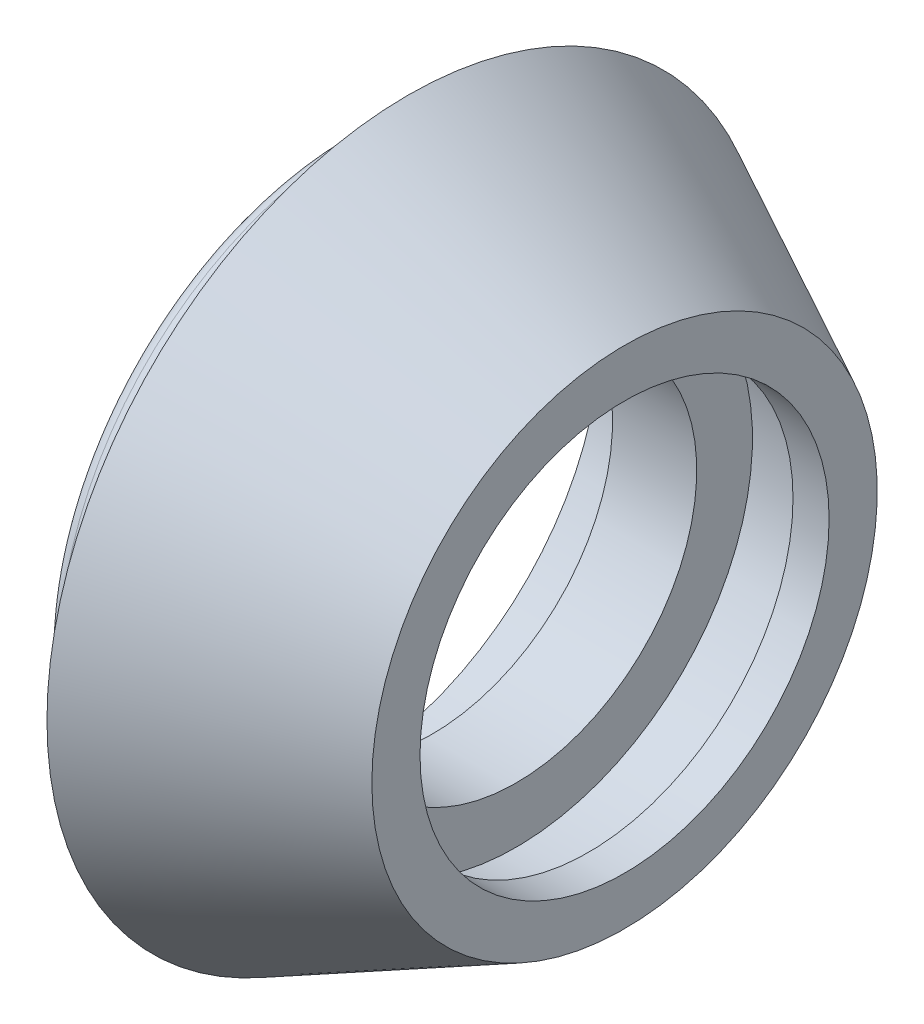
ISO-10303-21;
HEADER;
FILE_DESCRIPTION(('STEP AP214'),'2;1');
FILE_NAME('part.step','',(''),(''),'','','');
FILE_SCHEMA(('AUTOMOTIVE_DESIGN { 1 0 10303 214 1 1 1 1 }'));
ENDSEC;
DATA;
#1=APPLICATION_CONTEXT('core data for automotive mechanical design processes');
#2=APPLICATION_PROTOCOL_DEFINITION('international standard','automotive_design',2000,#1);
#3=PRODUCT_CONTEXT('',#1,'mechanical');
#4=PRODUCT('Part','Part','',(#3));
#5=PRODUCT_RELATED_PRODUCT_CATEGORY('part','',(#4));
#6=PRODUCT_DEFINITION_FORMATION('','',#4);
#7=PRODUCT_DEFINITION_CONTEXT('part definition',#1,'design');
#8=PRODUCT_DEFINITION('design','',#6,#7);
#9=PRODUCT_DEFINITION_SHAPE('','',#8);
#10=(LENGTH_UNIT() NAMED_UNIT(*) SI_UNIT(.MILLI.,.METRE.));
#11=(NAMED_UNIT(*) PLANE_ANGLE_UNIT() SI_UNIT($,.RADIAN.));
#12=(NAMED_UNIT(*) SI_UNIT($,.STERADIAN.) SOLID_ANGLE_UNIT());
#13=UNCERTAINTY_MEASURE_WITH_UNIT(LENGTH_MEASURE(1.E-05),#10,'distance_accuracy_value','');
#14=(GEOMETRIC_REPRESENTATION_CONTEXT(3) GLOBAL_UNCERTAINTY_ASSIGNED_CONTEXT((#13)) GLOBAL_UNIT_ASSIGNED_CONTEXT((#10,
#11,#12)) REPRESENTATION_CONTEXT('',''));
#15=CARTESIAN_POINT('',(0.,0.,0.));
#16=DIRECTION('',(0.,0.,1.));
#17=DIRECTION('',(1.,0.,0.));
#18=AXIS2_PLACEMENT_3D('',#15,#16,#17);
#19=CARTESIAN_POINT('',(-7.99999999999999,7.50000000000017,2.4980018054066E-13));
#20=DIRECTION('',(1.,0.,0.));
#21=DIRECTION('',(0.,0.,-0.999999999999999));
#22=AXIS2_PLACEMENT_3D('',#19,#20,#21);
#23=PLANE('',#22);
#24=CARTESIAN_POINT('',(-7.99999999999999,0.,1.38777878078145E-13));
#25=DIRECTION('',(-1.,0.,0.));
#26=DIRECTION('',(0.,0.,0.999999999999999));
#27=AXIS2_PLACEMENT_3D('',#24,#25,#26);
#28=CIRCLE('',#27,7.5);
#29=CARTESIAN_POINT('',(-7.99999999999999,0.,7.50000000000013));
#30=VERTEX_POINT('',#29);
#31=EDGE_CURVE('E73',#30,#30,#28,.T.);
#32=ORIENTED_EDGE('',*,*,#31,.F.);
#33=EDGE_LOOP('',(#32));
#34=FACE_BOUND('',#33,.T.);
#35=CARTESIAN_POINT('',(-7.99999999999999,0.,1.38777878078145E-13));
#36=DIRECTION('',(-1.,0.,0.));
#37=DIRECTION('',(0.,0.,0.999999999999999));
#38=AXIS2_PLACEMENT_3D('',#35,#36,#37);
#39=CIRCLE('',#38,10.5);
#40=CARTESIAN_POINT('',(-7.99999999999999,0.,10.5000000000001));
#41=VERTEX_POINT('',#40);
#42=EDGE_CURVE('E34',#41,#41,#39,.T.);
#43=ORIENTED_EDGE('',*,*,#42,.T.);
#44=EDGE_LOOP('',(#43));
#45=FACE_BOUND('',#44,.T.);
#46=ADVANCED_FACE('F24',(#34,#45),#23,.F.);
#47=CARTESIAN_POINT('',(-27.6062610229277,2.22044604925031E-13,2.22044604925031E-13));
#48=DIRECTION('',(-1.,0.,0.));
#49=DIRECTION('',(0.,0.,0.999999999999999));
#50=AXIS2_PLACEMENT_3D('',#47,#48,#49);
#51=CYLINDRICAL_SURFACE('',#50,10.5);
#52=ORIENTED_EDGE('',*,*,#42,.F.);
#53=EDGE_LOOP('',(#52));
#54=FACE_BOUND('',#53,.T.);
#55=CARTESIAN_POINT('',(-11.5,0.,0.));
#56=DIRECTION('',(-1.,0.,0.));
#57=DIRECTION('',(0.,0.,0.999999999999999));
#58=AXIS2_PLACEMENT_3D('',#55,#56,#57);
#59=CIRCLE('',#58,10.5);
#60=CARTESIAN_POINT('',(-11.5,0.,10.5));
#61=VERTEX_POINT('',#60);
#62=EDGE_CURVE('E38',#61,#61,#59,.T.);
#63=ORIENTED_EDGE('',*,*,#62,.T.);
#64=EDGE_LOOP('',(#63));
#65=FACE_BOUND('',#64,.T.);
#66=ADVANCED_FACE('F81',(#54,#65),#51,.F.);
#67=CARTESIAN_POINT('',(-11.5,12.5000000000002,1.11022302462516E-13));
#68=DIRECTION('',(1.,0.,0.));
#69=DIRECTION('',(0.,0.,-0.999999999999999));
#70=AXIS2_PLACEMENT_3D('',#67,#68,#69);
#71=PLANE('',#70);
#72=CARTESIAN_POINT('',(-11.5,0.,0.));
#73=DIRECTION('',(1.,0.,0.));
#74=DIRECTION('',(0.,0.,-0.999999999999999));
#75=AXIS2_PLACEMENT_3D('',#72,#73,#74);
#76=CIRCLE('',#75,12.);
#77=CARTESIAN_POINT('',(-11.5,0.,-12.));
#78=VERTEX_POINT('',#77);
#79=EDGE_CURVE('E30',#78,#78,#76,.F.);
#80=ORIENTED_EDGE('',*,*,#79,.T.);
#81=EDGE_LOOP('',(#80));
#82=FACE_BOUND('',#81,.T.);
#83=ORIENTED_EDGE('',*,*,#62,.F.);
#84=EDGE_LOOP('',(#83));
#85=FACE_BOUND('',#84,.T.);
#86=ADVANCED_FACE('F86',(#82,#85),#71,.F.);
#87=CARTESIAN_POINT('',(-27.6062610229277,2.22044604925031E-13,2.22044604925031E-13));
#88=DIRECTION('',(-1.,0.,0.));
#89=DIRECTION('',(0.,0.,0.999999999999999));
#90=AXIS2_PLACEMENT_3D('',#87,#88,#89);
#91=CYLINDRICAL_SURFACE('',#90,12.5);
#92=CARTESIAN_POINT('',(-11.,1.11022302462516E-13,0.));
#93=DIRECTION('',(1.,0.,0.));
#94=DIRECTION('',(0.,0.,-0.999999999999999));
#95=AXIS2_PLACEMENT_3D('',#92,#93,#94);
#96=CIRCLE('',#95,12.5);
#97=CARTESIAN_POINT('',(-11.,1.09287578986539E-13,-12.5));
#98=VERTEX_POINT('',#97);
#99=EDGE_CURVE('E10',#98,#98,#96,.T.);
#100=ORIENTED_EDGE('',*,*,#99,.T.);
#101=EDGE_LOOP('',(#100));
#102=FACE_BOUND('',#101,.T.);
#103=CARTESIAN_POINT('',(-10.5,1.11022302462516E-13,1.11022302462516E-13));
#104=DIRECTION('',(-1.,0.,0.));
#105=DIRECTION('',(0.,0.,0.999999999999999));
#106=AXIS2_PLACEMENT_3D('',#103,#104,#105);
#107=CIRCLE('',#106,12.5);
#108=CARTESIAN_POINT('',(-10.5,1.12757025938492E-13,12.5000000000001));
#109=VERTEX_POINT('',#108);
#110=EDGE_CURVE('E43',#109,#109,#107,.T.);
#111=ORIENTED_EDGE('',*,*,#110,.T.);
#112=EDGE_LOOP('',(#111));
#113=FACE_BOUND('',#112,.T.);
#114=ADVANCED_FACE('F90',(#102,#113),#91,.T.);
#115=CARTESIAN_POINT('',(-10.5,12.0000000000001,1.38777878078145E-13));
#116=DIRECTION('',(-1.,0.,0.));
#117=DIRECTION('',(0.,0.,0.999999999999999));
#118=AXIS2_PLACEMENT_3D('',#115,#116,#117);
#119=PLANE('',#118);
#120=ORIENTED_EDGE('',*,*,#110,.F.);
#121=EDGE_LOOP('',(#120));
#122=FACE_BOUND('',#121,.T.);
#123=CARTESIAN_POINT('',(-10.5,1.11022302462516E-13,1.11022302462516E-13));
#124=DIRECTION('',(-1.,0.,0.));
#125=DIRECTION('',(0.,0.,0.999999999999999));
#126=AXIS2_PLACEMENT_3D('',#123,#124,#125);
#127=CIRCLE('',#126,12.);
#128=CARTESIAN_POINT('',(-10.5,1.12687636999453E-13,12.0000000000001));
#129=VERTEX_POINT('',#128);
#130=EDGE_CURVE('E46',#129,#129,#127,.T.);
#131=ORIENTED_EDGE('',*,*,#130,.T.);
#132=EDGE_LOOP('',(#131));
#133=FACE_BOUND('',#132,.T.);
#134=ADVANCED_FACE('F95',(#122,#133),#119,.F.);
#135=CARTESIAN_POINT('',(-27.6062610229277,2.22044604925031E-13,2.22044604925031E-13));
#136=DIRECTION('',(-1.,0.,0.));
#137=DIRECTION('',(0.,0.,0.999999999999999));
#138=AXIS2_PLACEMENT_3D('',#135,#136,#137);
#139=CYLINDRICAL_SURFACE('',#138,12.);
#140=ORIENTED_EDGE('',*,*,#130,.F.);
#141=EDGE_LOOP('',(#140));
#142=FACE_BOUND('',#141,.T.);
#143=CARTESIAN_POINT('',(-9.00000000000001,2.22044604925031E-13,1.11022302462516E-13));
#144=DIRECTION('',(-1.,0.,0.));
#145=DIRECTION('',(0.,0.,0.999999999999999));
#146=AXIS2_PLACEMENT_3D('',#143,#144,#145);
#147=CIRCLE('',#146,12.);
#148=CARTESIAN_POINT('',(-9.00000000000001,2.23709939461969E-13,12.0000000000001));
#149=VERTEX_POINT('',#148);
#150=EDGE_CURVE('E49',#149,#149,#147,.T.);
#151=ORIENTED_EDGE('',*,*,#150,.T.);
#152=EDGE_LOOP('',(#151));
#153=FACE_BOUND('',#152,.T.);
#154=ADVANCED_FACE('F100',(#142,#153),#139,.T.);
#155=CARTESIAN_POINT('',(-8.99999999999999,15.,1.11022302462516E-13));
#156=DIRECTION('',(1.,0.,0.));
#157=DIRECTION('',(0.,0.,-0.999999999999999));
#158=AXIS2_PLACEMENT_3D('',#155,#156,#157);
#159=PLANE('',#158);
#160=ORIENTED_EDGE('',*,*,#150,.F.);
#161=EDGE_LOOP('',(#160));
#162=FACE_BOUND('',#161,.T.);
#163=CARTESIAN_POINT('',(-9.00000000000001,2.22044604925031E-13,1.11022302462516E-13));
#164=DIRECTION('',(-1.,0.,0.));
#165=DIRECTION('',(0.,0.,0.999999999999999));
#166=AXIS2_PLACEMENT_3D('',#163,#164,#165);
#167=CIRCLE('',#166,15.);
#168=CARTESIAN_POINT('',(-9.00000000000001,2.24126273096203E-13,15.0000000000001));
#169=VERTEX_POINT('',#168);
#170=EDGE_CURVE('E52',#169,#169,#167,.T.);
#171=ORIENTED_EDGE('',*,*,#170,.T.);
#172=EDGE_LOOP('',(#171));
#173=FACE_BOUND('',#172,.T.);
#174=ADVANCED_FACE('F104',(#162,#173),#159,.F.);
#175=CARTESIAN_POINT('',(0.,1.11022302462516E-13,0.));
#176=DIRECTION('',(-1.,0.,0.));
#177=DIRECTION('',(0.,0.,0.999999999999999));
#178=AXIS2_PLACEMENT_3D('',#175,#176,#177);
#179=CONICAL_SURFACE('',#178,10.5,0.463647609000806);
#180=ORIENTED_EDGE('',*,*,#170,.F.);
#181=EDGE_LOOP('',(#180));
#182=FACE_BOUND('',#181,.T.);
#183=CARTESIAN_POINT('',(0.,1.11022302462516E-13,0.));
#184=DIRECTION('',(-1.,0.,0.));
#185=DIRECTION('',(0.,0.,0.999999999999999));
#186=AXIS2_PLACEMENT_3D('',#183,#184,#185);
#187=CIRCLE('',#186,10.5);
#188=CARTESIAN_POINT('',(0.,1.12479470182336E-13,10.5));
#189=VERTEX_POINT('',#188);
#190=EDGE_CURVE('E55',#189,#189,#187,.T.);
#191=ORIENTED_EDGE('',*,*,#190,.T.);
#192=EDGE_LOOP('',(#191));
#193=FACE_BOUND('',#192,.T.);
#194=ADVANCED_FACE('F108',(#182,#193),#179,.T.);
#195=CARTESIAN_POINT('',(0.,8.50000000000017,1.11022302462516E-13));
#196=DIRECTION('',(-1.,0.,0.));
#197=DIRECTION('',(0.,0.,0.999999999999999));
#198=AXIS2_PLACEMENT_3D('',#195,#196,#197);
#199=PLANE('',#198);
#200=ORIENTED_EDGE('',*,*,#190,.F.);
#201=EDGE_LOOP('',(#200));
#202=FACE_BOUND('',#201,.T.);
#203=CARTESIAN_POINT('',(0.,1.11022302462516E-13,0.));
#204=DIRECTION('',(-1.,0.,0.));
#205=DIRECTION('',(0.,0.,0.999999999999999));
#206=AXIS2_PLACEMENT_3D('',#203,#204,#205);
#207=CIRCLE('',#206,8.5);
#208=CARTESIAN_POINT('',(0.,1.1220191442618E-13,8.49999999999999));
#209=VERTEX_POINT('',#208);
#210=EDGE_CURVE('E58',#209,#209,#207,.T.);
#211=ORIENTED_EDGE('',*,*,#210,.T.);
#212=EDGE_LOOP('',(#211));
#213=FACE_BOUND('',#212,.T.);
#214=ADVANCED_FACE('F112',(#202,#213),#199,.F.);
#215=CARTESIAN_POINT('',(-27.6062610229277,2.22044604925031E-13,2.22044604925031E-13));
#216=DIRECTION('',(-1.,0.,0.));
#217=DIRECTION('',(0.,0.,0.999999999999999));
#218=AXIS2_PLACEMENT_3D('',#215,#216,#217);
#219=CYLINDRICAL_SURFACE('',#218,8.5);
#220=ORIENTED_EDGE('',*,*,#210,.F.);
#221=EDGE_LOOP('',(#220));
#222=FACE_BOUND('',#221,.T.);
#223=CARTESIAN_POINT('',(-1.49999999999999,1.11022302462516E-13,1.38777878078145E-13));
#224=DIRECTION('',(-1.,0.,0.));
#225=DIRECTION('',(0.,0.,0.999999999999999));
#226=AXIS2_PLACEMENT_3D('',#223,#224,#225);
#227=CIRCLE('',#226,8.5);
#228=CARTESIAN_POINT('',(-1.49999999999999,1.1220191442618E-13,8.50000000000014));
#229=VERTEX_POINT('',#228);
#230=EDGE_CURVE('E61',#229,#229,#227,.T.);
#231=ORIENTED_EDGE('',*,*,#230,.T.);
#232=EDGE_LOOP('',(#231));
#233=FACE_BOUND('',#232,.T.);
#234=ADVANCED_FACE('F116',(#222,#233),#219,.F.);
#235=CARTESIAN_POINT('',(-1.50000000000001,9.81500000000013,0.));
#236=DIRECTION('',(1.,0.,0.));
#237=DIRECTION('',(0.,0.,-0.999999999999999));
#238=AXIS2_PLACEMENT_3D('',#235,#236,#237);
#239=PLANE('',#238);
#240=ORIENTED_EDGE('',*,*,#230,.F.);
#241=EDGE_LOOP('',(#240));
#242=FACE_BOUND('',#241,.T.);
#243=CARTESIAN_POINT('',(-1.49999999999999,1.11022302462516E-13,1.38777878078145E-13));
#244=DIRECTION('',(-1.,0.,0.));
#245=DIRECTION('',(0.,0.,0.999999999999999));
#246=AXIS2_PLACEMENT_3D('',#243,#244,#245);
#247=CIRCLE('',#246,9.815);
#248=CARTESIAN_POINT('',(-1.49999999999999,1.12384407335853E-13,9.81500000000013));
#249=VERTEX_POINT('',#248);
#250=EDGE_CURVE('E64',#249,#249,#247,.T.);
#251=ORIENTED_EDGE('',*,*,#250,.T.);
#252=EDGE_LOOP('',(#251));
#253=FACE_BOUND('',#252,.T.);
#254=ADVANCED_FACE('F120',(#242,#253),#239,.F.);
#255=CARTESIAN_POINT('',(-27.6062610229277,2.22044604925031E-13,2.22044604925031E-13));
#256=DIRECTION('',(-1.,0.,0.));
#257=DIRECTION('',(0.,0.,0.999999999999999));
#258=AXIS2_PLACEMENT_3D('',#255,#256,#257);
#259=CYLINDRICAL_SURFACE('',#258,9.815);
#260=ORIENTED_EDGE('',*,*,#250,.F.);
#261=EDGE_LOOP('',(#260));
#262=FACE_BOUND('',#261,.T.);
#263=CARTESIAN_POINT('',(-4.49999999999999,0.,0.));
#264=DIRECTION('',(-1.,0.,0.));
#265=DIRECTION('',(0.,0.,0.999999999999999));
#266=AXIS2_PLACEMENT_3D('',#263,#264,#265);
#267=CIRCLE('',#266,9.815);
#268=CARTESIAN_POINT('',(-4.49999999999999,0.,9.81499999999999));
#269=VERTEX_POINT('',#268);
#270=EDGE_CURVE('E67',#269,#269,#267,.T.);
#271=ORIENTED_EDGE('',*,*,#270,.T.);
#272=EDGE_LOOP('',(#271));
#273=FACE_BOUND('',#272,.T.);
#274=ADVANCED_FACE('F124',(#262,#273),#259,.F.);
#275=CARTESIAN_POINT('',(-4.5,7.50000000000006,2.22044604925031E-13));
#276=DIRECTION('',(-1.,0.,0.));
#277=DIRECTION('',(0.,0.,0.999999999999999));
#278=AXIS2_PLACEMENT_3D('',#275,#276,#277);
#279=PLANE('',#278);
#280=ORIENTED_EDGE('',*,*,#270,.F.);
#281=EDGE_LOOP('',(#280));
#282=FACE_BOUND('',#281,.T.);
#283=CARTESIAN_POINT('',(-4.49999999999999,0.,0.));
#284=DIRECTION('',(-1.,0.,0.));
#285=DIRECTION('',(0.,0.,0.999999999999999));
#286=AXIS2_PLACEMENT_3D('',#283,#284,#285);
#287=CIRCLE('',#286,7.5);
#288=CARTESIAN_POINT('',(-4.49999999999999,0.,7.5));
#289=VERTEX_POINT('',#288);
#290=EDGE_CURVE('E70',#289,#289,#287,.T.);
#291=ORIENTED_EDGE('',*,*,#290,.T.);
#292=EDGE_LOOP('',(#291));
#293=FACE_BOUND('',#292,.T.);
#294=ADVANCED_FACE('F128',(#282,#293),#279,.F.);
#295=CARTESIAN_POINT('',(-27.6062610229277,2.22044604925031E-13,2.22044604925031E-13));
#296=DIRECTION('',(-1.,0.,0.));
#297=DIRECTION('',(0.,0.,0.999999999999999));
#298=AXIS2_PLACEMENT_3D('',#295,#296,#297);
#299=CYLINDRICAL_SURFACE('',#298,7.5);
#300=ORIENTED_EDGE('',*,*,#290,.F.);
#301=EDGE_LOOP('',(#300));
#302=FACE_BOUND('',#301,.T.);
#303=ORIENTED_EDGE('',*,*,#31,.T.);
#304=EDGE_LOOP('',(#303));
#305=FACE_BOUND('',#304,.T.);
#306=ADVANCED_FACE('F77',(#302,#305),#299,.F.);
#307=CARTESIAN_POINT('',(-11.,1.11022302462516E-13,0.));
#308=DIRECTION('',(1.,0.,0.));
#309=DIRECTION('',(0.,0.,-0.999999999999999));
#310=AXIS2_PLACEMENT_3D('',#307,#308,#309);
#311=TOROIDAL_SURFACE('',#310,12.,0.5);
#312=ORIENTED_EDGE('',*,*,#99,.F.);
#313=EDGE_LOOP('',(#312));
#314=FACE_BOUND('',#313,.T.);
#315=ORIENTED_EDGE('',*,*,#79,.F.);
#316=EDGE_LOOP('',(#315));
#317=FACE_BOUND('',#316,.T.);
#318=ADVANCED_FACE('F135',(#314,#317),#311,.T.);
#319=CLOSED_SHELL('',(#46,#66,#86,#114,#134,#154,#174,#194,#214,#234,#254,#274,#294,#306,#318));
#320=MANIFOLD_SOLID_BREP('B2',#319);
#321=ADVANCED_BREP_SHAPE_REPRESENTATION('',(#18,#320),#14);
#322=SHAPE_DEFINITION_REPRESENTATION(#9,#321);
ENDSEC;
END-ISO-10303-21;
